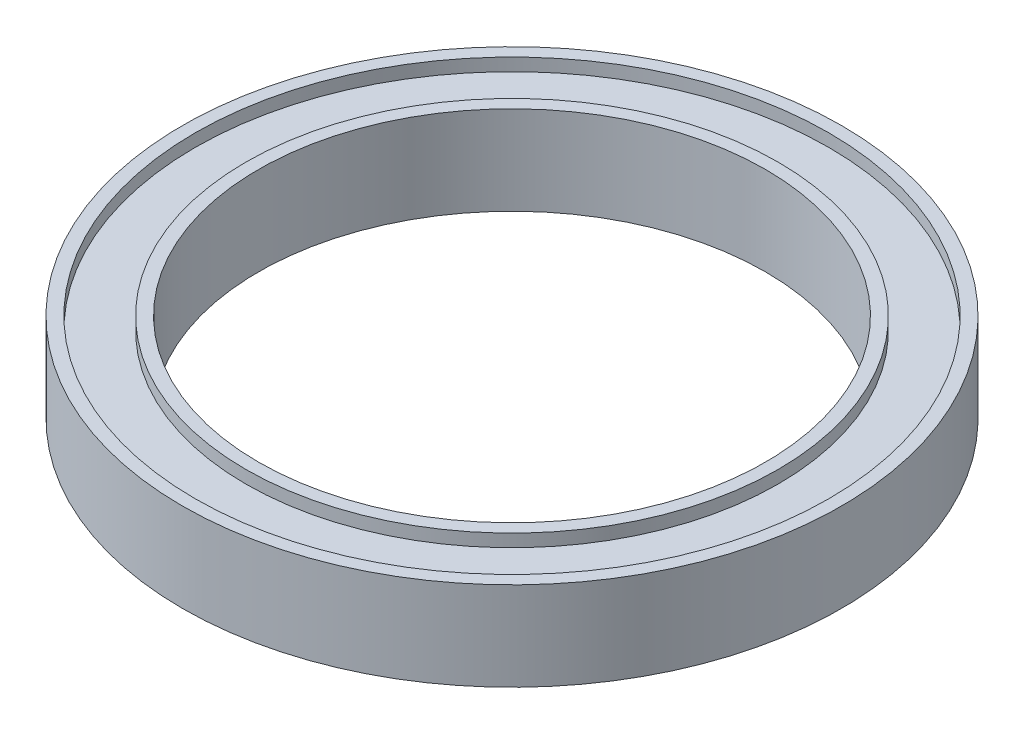
ISO-10303-21;
HEADER;
FILE_DESCRIPTION(('STEP AP214'),'2;1');
FILE_NAME('part.step','',(''),(''),'','','');
FILE_SCHEMA(('AUTOMOTIVE_DESIGN { 1 0 10303 214 1 1 1 1 }'));
ENDSEC;
DATA;
#1=APPLICATION_CONTEXT('core data for automotive mechanical design processes');
#2=APPLICATION_PROTOCOL_DEFINITION('international standard','automotive_design',2000,#1);
#3=PRODUCT_CONTEXT('',#1,'mechanical');
#4=PRODUCT('Part','Part','',(#3));
#5=PRODUCT_RELATED_PRODUCT_CATEGORY('part','',(#4));
#6=PRODUCT_DEFINITION_FORMATION('','',#4);
#7=PRODUCT_DEFINITION_CONTEXT('part definition',#1,'design');
#8=PRODUCT_DEFINITION('design','',#6,#7);
#9=PRODUCT_DEFINITION_SHAPE('','',#8);
#10=(LENGTH_UNIT() NAMED_UNIT(*) SI_UNIT(.MILLI.,.METRE.));
#11=(NAMED_UNIT(*) PLANE_ANGLE_UNIT() SI_UNIT($,.RADIAN.));
#12=(NAMED_UNIT(*) SI_UNIT($,.STERADIAN.) SOLID_ANGLE_UNIT());
#13=UNCERTAINTY_MEASURE_WITH_UNIT(LENGTH_MEASURE(1.E-05),#10,'distance_accuracy_value','');
#14=(GEOMETRIC_REPRESENTATION_CONTEXT(3) GLOBAL_UNCERTAINTY_ASSIGNED_CONTEXT((#13)) GLOBAL_UNIT_ASSIGNED_CONTEXT((#10,
#11,#12)) REPRESENTATION_CONTEXT('',''));
#15=CARTESIAN_POINT('',(0.,0.,0.));
#16=DIRECTION('',(0.,0.,1.));
#17=DIRECTION('',(1.,0.,0.));
#18=AXIS2_PLACEMENT_3D('',#15,#16,#17);
#19=CARTESIAN_POINT('',(0.,-3.5,0.));
#20=DIRECTION('',(0.,1.,0.));
#21=DIRECTION('',(0.,0.,1.));
#22=AXIS2_PLACEMENT_3D('',#19,#20,#21);
#23=PLANE('',#22);
#24=CARTESIAN_POINT('',(0.,-3.5,0.));
#25=DIRECTION('',(0.,1.,0.));
#26=DIRECTION('',(0.,0.,1.));
#27=AXIS2_PLACEMENT_3D('',#24,#25,#26);
#28=CIRCLE('',#27,20.);
#29=CARTESIAN_POINT('',(0.,-3.5,20.));
#30=VERTEX_POINT('',#29);
#31=EDGE_CURVE('E44',#30,#30,#28,.T.);
#32=ORIENTED_EDGE('',*,*,#31,.T.);
#33=EDGE_LOOP('',(#32));
#34=FACE_BOUND('',#33,.T.);
#35=CARTESIAN_POINT('',(0.,-3.5,0.));
#36=DIRECTION('',(0.,1.,0.));
#37=DIRECTION('',(0.,0.,1.));
#38=AXIS2_PLACEMENT_3D('',#35,#36,#37);
#39=CIRCLE('',#38,21.);
#40=CARTESIAN_POINT('',(0.,-3.5,21.));
#41=VERTEX_POINT('',#40);
#42=EDGE_CURVE('E68',#41,#41,#39,.T.);
#43=ORIENTED_EDGE('',*,*,#42,.F.);
#44=EDGE_LOOP('',(#43));
#45=FACE_BOUND('',#44,.T.);
#46=ADVANCED_FACE('F31',(#34,#45),#23,.F.);
#47=CARTESIAN_POINT('',(0.,3.5,0.));
#48=DIRECTION('',(0.,1.,0.));
#49=DIRECTION('',(0.,0.,1.));
#50=AXIS2_PLACEMENT_3D('',#47,#48,#49);
#51=PLANE('',#50);
#52=CARTESIAN_POINT('',(0.,3.5,0.));
#53=DIRECTION('',(0.,1.,0.));
#54=DIRECTION('',(0.,0.,1.));
#55=AXIS2_PLACEMENT_3D('',#52,#53,#54);
#56=CIRCLE('',#55,20.);
#57=CARTESIAN_POINT('',(0.,3.5,20.));
#58=VERTEX_POINT('',#57);
#59=EDGE_CURVE('E42',#58,#58,#56,.T.);
#60=ORIENTED_EDGE('',*,*,#59,.F.);
#61=EDGE_LOOP('',(#60));
#62=FACE_BOUND('',#61,.T.);
#63=CARTESIAN_POINT('',(0.,3.5,0.));
#64=DIRECTION('',(0.,1.,0.));
#65=DIRECTION('',(0.,0.,1.));
#66=AXIS2_PLACEMENT_3D('',#63,#64,#65);
#67=CIRCLE('',#66,21.);
#68=CARTESIAN_POINT('',(0.,3.5,21.));
#69=VERTEX_POINT('',#68);
#70=EDGE_CURVE('E56',#69,#69,#67,.T.);
#71=ORIENTED_EDGE('',*,*,#70,.T.);
#72=EDGE_LOOP('',(#71));
#73=FACE_BOUND('',#72,.T.);
#74=ADVANCED_FACE('F84',(#62,#73),#51,.T.);
#75=CARTESIAN_POINT('',(0.,3.5,0.));
#76=DIRECTION('',(0.,1.,0.));
#77=DIRECTION('',(0.,0.,1.));
#78=AXIS2_PLACEMENT_3D('',#75,#76,#77);
#79=CIRCLE('',#78,25.);
#80=CARTESIAN_POINT('',(0.,3.5,25.));
#81=VERTEX_POINT('',#80);
#82=EDGE_CURVE('E50',#81,#81,#79,.T.);
#83=ORIENTED_EDGE('',*,*,#82,.F.);
#84=EDGE_LOOP('',(#83));
#85=FACE_BOUND('',#84,.T.);
#86=CARTESIAN_POINT('',(0.,3.5,0.));
#87=DIRECTION('',(0.,1.,0.));
#88=DIRECTION('',(0.,0.,1.));
#89=AXIS2_PLACEMENT_3D('',#86,#87,#88);
#90=CIRCLE('',#89,26.);
#91=CARTESIAN_POINT('',(0.,3.5,26.));
#92=VERTEX_POINT('',#91);
#93=EDGE_CURVE('E10',#92,#92,#90,.T.);
#94=ORIENTED_EDGE('',*,*,#93,.T.);
#95=EDGE_LOOP('',(#94));
#96=FACE_BOUND('',#95,.T.);
#97=ADVANCED_FACE('F90',(#85,#96),#51,.T.);
#98=CARTESIAN_POINT('',(0.,-3.5,0.));
#99=DIRECTION('',(0.,1.,0.));
#100=DIRECTION('',(0.,0.,1.));
#101=AXIS2_PLACEMENT_3D('',#98,#99,#100);
#102=CIRCLE('',#101,25.);
#103=CARTESIAN_POINT('',(0.,-3.5,25.));
#104=VERTEX_POINT('',#103);
#105=EDGE_CURVE('E62',#104,#104,#102,.T.);
#106=ORIENTED_EDGE('',*,*,#105,.T.);
#107=EDGE_LOOP('',(#106));
#108=FACE_BOUND('',#107,.T.);
#109=CARTESIAN_POINT('',(0.,-3.5,0.));
#110=DIRECTION('',(0.,1.,0.));
#111=DIRECTION('',(0.,0.,1.));
#112=AXIS2_PLACEMENT_3D('',#109,#110,#111);
#113=CIRCLE('',#112,26.);
#114=CARTESIAN_POINT('',(0.,-3.5,26.));
#115=VERTEX_POINT('',#114);
#116=EDGE_CURVE('E35',#115,#115,#113,.T.);
#117=ORIENTED_EDGE('',*,*,#116,.F.);
#118=EDGE_LOOP('',(#117));
#119=FACE_BOUND('',#118,.T.);
#120=ADVANCED_FACE('F86',(#108,#119),#23,.F.);
#121=CARTESIAN_POINT('',(0.,3.5,0.));
#122=DIRECTION('',(0.,-1.,0.));
#123=DIRECTION('',(0.,0.,-1.));
#124=AXIS2_PLACEMENT_3D('',#121,#122,#123);
#125=CYLINDRICAL_SURFACE('',#124,26.);
#126=ORIENTED_EDGE('',*,*,#93,.F.);
#127=EDGE_LOOP('',(#126));
#128=FACE_BOUND('',#127,.T.);
#129=ORIENTED_EDGE('',*,*,#116,.T.);
#130=EDGE_LOOP('',(#129));
#131=FACE_BOUND('',#130,.T.);
#132=ADVANCED_FACE('F33',(#128,#131),#125,.T.);
#133=CARTESIAN_POINT('',(0.,3.5,0.));
#134=DIRECTION('',(0.,-1.,0.));
#135=DIRECTION('',(0.,0.,-1.));
#136=AXIS2_PLACEMENT_3D('',#133,#134,#135);
#137=CYLINDRICAL_SURFACE('',#136,20.);
#138=ORIENTED_EDGE('',*,*,#59,.T.);
#139=EDGE_LOOP('',(#138));
#140=FACE_BOUND('',#139,.T.);
#141=ORIENTED_EDGE('',*,*,#31,.F.);
#142=EDGE_LOOP('',(#141));
#143=FACE_BOUND('',#142,.T.);
#144=ADVANCED_FACE('F99',(#140,#143),#137,.F.);
#145=CARTESIAN_POINT('',(0.,2.5,0.));
#146=DIRECTION('',(0.,1.,0.));
#147=DIRECTION('',(0.,0.,1.));
#148=AXIS2_PLACEMENT_3D('',#145,#146,#147);
#149=CYLINDRICAL_SURFACE('',#148,25.);
#150=CARTESIAN_POINT('',(0.,2.5,0.));
#151=DIRECTION('',(0.,1.,0.));
#152=DIRECTION('',(0.,0.,1.));
#153=AXIS2_PLACEMENT_3D('',#150,#151,#152);
#154=CIRCLE('',#153,25.);
#155=CARTESIAN_POINT('',(0.,2.5,25.));
#156=VERTEX_POINT('',#155);
#157=EDGE_CURVE('E47',#156,#156,#154,.T.);
#158=ORIENTED_EDGE('',*,*,#157,.F.);
#159=EDGE_LOOP('',(#158));
#160=FACE_BOUND('',#159,.T.);
#161=ORIENTED_EDGE('',*,*,#82,.T.);
#162=EDGE_LOOP('',(#161));
#163=FACE_BOUND('',#162,.T.);
#164=ADVANCED_FACE('F123',(#160,#163),#149,.F.);
#165=CARTESIAN_POINT('',(0.,2.5,0.));
#166=DIRECTION('',(0.,1.,0.));
#167=DIRECTION('',(0.,0.,1.));
#168=AXIS2_PLACEMENT_3D('',#165,#166,#167);
#169=PLANE('',#168);
#170=CARTESIAN_POINT('',(0.,2.5,0.));
#171=DIRECTION('',(0.,1.,0.));
#172=DIRECTION('',(0.,0.,1.));
#173=AXIS2_PLACEMENT_3D('',#170,#171,#172);
#174=CIRCLE('',#173,21.);
#175=CARTESIAN_POINT('',(0.,2.5,21.));
#176=VERTEX_POINT('',#175);
#177=EDGE_CURVE('E53',#176,#176,#174,.T.);
#178=ORIENTED_EDGE('',*,*,#177,.F.);
#179=EDGE_LOOP('',(#178));
#180=FACE_BOUND('',#179,.T.);
#181=ORIENTED_EDGE('',*,*,#157,.T.);
#182=EDGE_LOOP('',(#181));
#183=FACE_BOUND('',#182,.T.);
#184=ADVANCED_FACE('F119',(#180,#183),#169,.T.);
#185=CARTESIAN_POINT('',(0.,2.5,0.));
#186=DIRECTION('',(0.,1.,0.));
#187=DIRECTION('',(0.,0.,1.));
#188=AXIS2_PLACEMENT_3D('',#185,#186,#187);
#189=CYLINDRICAL_SURFACE('',#188,21.);
#190=ORIENTED_EDGE('',*,*,#177,.T.);
#191=EDGE_LOOP('',(#190));
#192=FACE_BOUND('',#191,.T.);
#193=ORIENTED_EDGE('',*,*,#70,.F.);
#194=EDGE_LOOP('',(#193));
#195=FACE_BOUND('',#194,.T.);
#196=ADVANCED_FACE('F113',(#192,#195),#189,.T.);
#197=CARTESIAN_POINT('',(0.,-2.5,0.));
#198=DIRECTION('',(0.,-1.,0.));
#199=DIRECTION('',(0.,0.,1.));
#200=AXIS2_PLACEMENT_3D('',#197,#198,#199);
#201=PLANE('',#200);
#202=CARTESIAN_POINT('',(0.,-2.5,0.));
#203=DIRECTION('',(0.,1.,0.));
#204=DIRECTION('',(0.,0.,1.));
#205=AXIS2_PLACEMENT_3D('',#202,#203,#204);
#206=CIRCLE('',#205,25.);
#207=CARTESIAN_POINT('',(0.,-2.5,25.));
#208=VERTEX_POINT('',#207);
#209=EDGE_CURVE('E59',#208,#208,#206,.T.);
#210=ORIENTED_EDGE('',*,*,#209,.F.);
#211=EDGE_LOOP('',(#210));
#212=FACE_BOUND('',#211,.T.);
#213=CARTESIAN_POINT('',(0.,-2.5,0.));
#214=DIRECTION('',(0.,1.,0.));
#215=DIRECTION('',(0.,0.,1.));
#216=AXIS2_PLACEMENT_3D('',#213,#214,#215);
#217=CIRCLE('',#216,21.);
#218=CARTESIAN_POINT('',(0.,-2.5,21.));
#219=VERTEX_POINT('',#218);
#220=EDGE_CURVE('E65',#219,#219,#217,.T.);
#221=ORIENTED_EDGE('',*,*,#220,.T.);
#222=EDGE_LOOP('',(#221));
#223=FACE_BOUND('',#222,.T.);
#224=ADVANCED_FACE('F74',(#212,#223),#201,.T.);
#225=CARTESIAN_POINT('',(0.,-2.5,0.));
#226=DIRECTION('',(0.,-1.,0.));
#227=DIRECTION('',(0.,0.,-1.));
#228=AXIS2_PLACEMENT_3D('',#225,#226,#227);
#229=CYLINDRICAL_SURFACE('',#228,25.);
#230=ORIENTED_EDGE('',*,*,#209,.T.);
#231=EDGE_LOOP('',(#230));
#232=FACE_BOUND('',#231,.T.);
#233=ORIENTED_EDGE('',*,*,#105,.F.);
#234=EDGE_LOOP('',(#233));
#235=FACE_BOUND('',#234,.T.);
#236=ADVANCED_FACE('F79',(#232,#235),#229,.F.);
#237=CARTESIAN_POINT('',(0.,-2.5,0.));
#238=DIRECTION('',(0.,-1.,0.));
#239=DIRECTION('',(0.,0.,-1.));
#240=AXIS2_PLACEMENT_3D('',#237,#238,#239);
#241=CYLINDRICAL_SURFACE('',#240,21.);
#242=ORIENTED_EDGE('',*,*,#220,.F.);
#243=EDGE_LOOP('',(#242));
#244=FACE_BOUND('',#243,.T.);
#245=ORIENTED_EDGE('',*,*,#42,.T.);
#246=EDGE_LOOP('',(#245));
#247=FACE_BOUND('',#246,.T.);
#248=ADVANCED_FACE('F76',(#244,#247),#241,.T.);
#249=CLOSED_SHELL('',(#46,#74,#97,#120,#132,#144,#164,#184,#196,#224,#236,#248));
#250=MANIFOLD_SOLID_BREP('B2',#249);
#251=ADVANCED_BREP_SHAPE_REPRESENTATION('',(#18,#250),#14);
#252=SHAPE_DEFINITION_REPRESENTATION(#9,#251);
ENDSEC;
END-ISO-10303-21;
